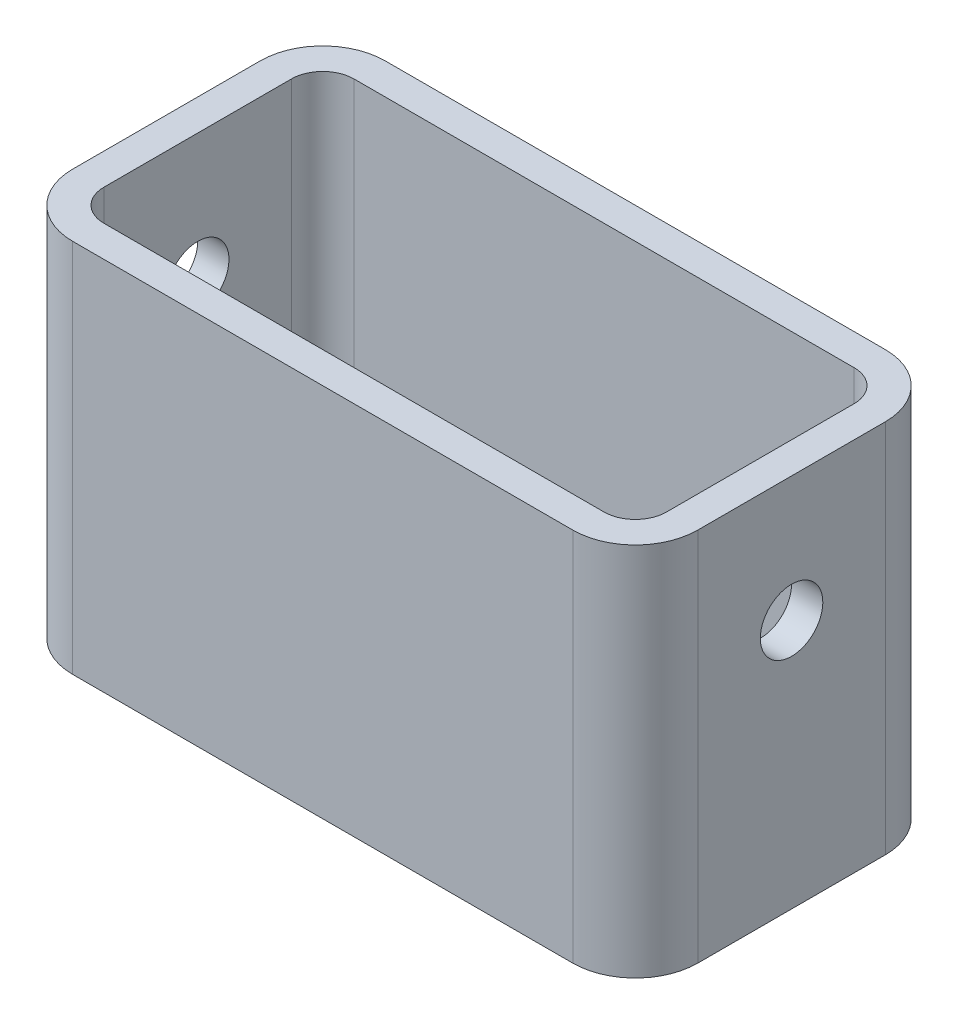
ISO-10303-21;
HEADER;
FILE_DESCRIPTION(('STEP AP214'),'2;1');
FILE_NAME('part.step','',(''),(''),'','','');
FILE_SCHEMA(('AUTOMOTIVE_DESIGN { 1 0 10303 214 1 1 1 1 }'));
ENDSEC;
DATA;
#1=APPLICATION_CONTEXT('core data for automotive mechanical design processes');
#2=APPLICATION_PROTOCOL_DEFINITION('international standard','automotive_design',2000,#1);
#3=PRODUCT_CONTEXT('',#1,'mechanical');
#4=PRODUCT('Part','Part','',(#3));
#5=PRODUCT_RELATED_PRODUCT_CATEGORY('part','',(#4));
#6=PRODUCT_DEFINITION_FORMATION('','',#4);
#7=PRODUCT_DEFINITION_CONTEXT('part definition',#1,'design');
#8=PRODUCT_DEFINITION('design','',#6,#7);
#9=PRODUCT_DEFINITION_SHAPE('','',#8);
#10=(LENGTH_UNIT() NAMED_UNIT(*) SI_UNIT(.MILLI.,.METRE.));
#11=(NAMED_UNIT(*) PLANE_ANGLE_UNIT() SI_UNIT($,.RADIAN.));
#12=(NAMED_UNIT(*) SI_UNIT($,.STERADIAN.) SOLID_ANGLE_UNIT());
#13=UNCERTAINTY_MEASURE_WITH_UNIT(LENGTH_MEASURE(1.E-05),#10,'distance_accuracy_value','');
#14=(GEOMETRIC_REPRESENTATION_CONTEXT(3) GLOBAL_UNCERTAINTY_ASSIGNED_CONTEXT((#13)) GLOBAL_UNIT_ASSIGNED_CONTEXT((#10,
#11,#12)) REPRESENTATION_CONTEXT('',''));
#15=CARTESIAN_POINT('',(0.,0.,0.));
#16=DIRECTION('',(0.,0.,1.));
#17=DIRECTION('',(1.,0.,0.));
#18=AXIS2_PLACEMENT_3D('',#15,#16,#17);
#19=CARTESIAN_POINT('',(0.,0.,50.));
#20=DIRECTION('',(1.,0.,0.));
#21=DIRECTION('',(0.,1.,0.));
#22=AXIS2_PLACEMENT_3D('',#19,#20,#21);
#23=PLANE('',#22);
#24=CARTESIAN_POINT('',(0.,40.,25.));
#25=DIRECTION('',(1.,0.,0.));
#26=DIRECTION('',(0.,1.,0.));
#27=AXIS2_PLACEMENT_3D('',#24,#25,#26);
#28=CIRCLE('',#27,5.);
#29=CARTESIAN_POINT('',(0.,45.,25.));
#30=VERTEX_POINT('',#29);
#31=EDGE_CURVE('E363',#30,#30,#28,.T.);
#32=ORIENTED_EDGE('',*,*,#31,.T.);
#33=EDGE_LOOP('',(#32));
#34=FACE_BOUND('',#33,.T.);
#35=DIRECTION('',(0.,0.,-1.));
#36=VECTOR('',#35,1.);
#37=CARTESIAN_POINT('',(0.,60.,50.));
#38=LINE('',#37,#36);
#39=CARTESIAN_POINT('',(0.,60.,40.));
#40=VERTEX_POINT('',#39);
#41=CARTESIAN_POINT('',(0.,60.,10.));
#42=VERTEX_POINT('',#41);
#43=EDGE_CURVE('E213',#40,#42,#38,.T.);
#44=ORIENTED_EDGE('',*,*,#43,.T.);
#45=DIRECTION('',(0.,-1.,0.));
#46=VECTOR('',#45,1.);
#47=CARTESIAN_POINT('',(0.,0.,10.));
#48=LINE('',#47,#46);
#49=CARTESIAN_POINT('',(0.,0.,10.));
#50=VERTEX_POINT('',#49);
#51=EDGE_CURVE('E231',#42,#50,#48,.T.);
#52=ORIENTED_EDGE('',*,*,#51,.T.);
#53=DIRECTION('',(0.,0.,-1.));
#54=VECTOR('',#53,1.);
#55=CARTESIAN_POINT('',(0.,0.,50.));
#56=LINE('',#55,#54);
#57=CARTESIAN_POINT('',(0.,0.,40.));
#58=VERTEX_POINT('',#57);
#59=EDGE_CURVE('E226',#58,#50,#56,.T.);
#60=ORIENTED_EDGE('',*,*,#59,.F.);
#61=DIRECTION('',(0.,-1.,0.));
#62=VECTOR('',#61,1.);
#63=CARTESIAN_POINT('',(0.,0.,40.));
#64=LINE('',#63,#62);
#65=EDGE_CURVE('E229',#58,#40,#64,.F.);
#66=ORIENTED_EDGE('',*,*,#65,.T.);
#67=EDGE_LOOP('',(#44,#52,#60,#66));
#68=FACE_BOUND('',#67,.T.);
#69=ADVANCED_FACE('F33',(#34,#68),#23,.F.);
#70=CARTESIAN_POINT('',(0.,0.,50.));
#71=DIRECTION('',(0.,1.,0.));
#72=DIRECTION('',(0.,0.,1.));
#73=AXIS2_PLACEMENT_3D('',#70,#71,#72);
#74=PLANE('',#73);
#75=ORIENTED_EDGE('',*,*,#59,.T.);
#76=CARTESIAN_POINT('',(10.,0.,10.));
#77=DIRECTION('',(0.,1.,0.));
#78=DIRECTION('',(0.,0.,1.));
#79=AXIS2_PLACEMENT_3D('',#76,#77,#78);
#80=CIRCLE('',#79,10.);
#81=CARTESIAN_POINT('',(10.,0.,0.));
#82=VERTEX_POINT('',#81);
#83=EDGE_CURVE('E240',#50,#82,#80,.F.);
#84=ORIENTED_EDGE('',*,*,#83,.T.);
#85=DIRECTION('',(1.,0.,0.));
#86=VECTOR('',#85,1.);
#87=CARTESIAN_POINT('',(0.,0.,0.));
#88=LINE('',#87,#86);
#89=CARTESIAN_POINT('',(90.,0.,0.));
#90=VERTEX_POINT('',#89);
#91=EDGE_CURVE('E189',#82,#90,#88,.T.);
#92=ORIENTED_EDGE('',*,*,#91,.T.);
#93=CARTESIAN_POINT('',(90.,0.,10.));
#94=DIRECTION('',(0.,1.,0.));
#95=DIRECTION('',(0.,0.,1.));
#96=AXIS2_PLACEMENT_3D('',#93,#94,#95);
#97=CIRCLE('',#96,10.);
#98=CARTESIAN_POINT('',(100.,0.,10.));
#99=VERTEX_POINT('',#98);
#100=EDGE_CURVE('E238',#90,#99,#97,.F.);
#101=ORIENTED_EDGE('',*,*,#100,.T.);
#102=DIRECTION('',(0.,0.,-1.));
#103=VECTOR('',#102,1.);
#104=CARTESIAN_POINT('',(100.,0.,50.));
#105=LINE('',#104,#103);
#106=CARTESIAN_POINT('',(100.,0.,40.));
#107=VERTEX_POINT('',#106);
#108=EDGE_CURVE('E223',#107,#99,#105,.T.);
#109=ORIENTED_EDGE('',*,*,#108,.F.);
#110=CARTESIAN_POINT('',(90.,0.,40.));
#111=DIRECTION('',(0.,1.,0.));
#112=DIRECTION('',(0.,0.,1.));
#113=AXIS2_PLACEMENT_3D('',#110,#111,#112);
#114=CIRCLE('',#113,10.);
#115=CARTESIAN_POINT('',(90.,0.,50.));
#116=VERTEX_POINT('',#115);
#117=EDGE_CURVE('E234',#107,#116,#114,.F.);
#118=ORIENTED_EDGE('',*,*,#117,.T.);
#119=DIRECTION('',(1.,0.,0.));
#120=VECTOR('',#119,1.);
#121=CARTESIAN_POINT('',(0.,0.,50.));
#122=LINE('',#121,#120);
#123=CARTESIAN_POINT('',(10.,0.,50.));
#124=VERTEX_POINT('',#123);
#125=EDGE_CURVE('E206',#124,#116,#122,.T.);
#126=ORIENTED_EDGE('',*,*,#125,.F.);
#127=CARTESIAN_POINT('',(10.,0.,40.));
#128=DIRECTION('',(0.,1.,0.));
#129=DIRECTION('',(0.,0.,1.));
#130=AXIS2_PLACEMENT_3D('',#127,#128,#129);
#131=CIRCLE('',#130,10.);
#132=EDGE_CURVE('E236',#124,#58,#131,.F.);
#133=ORIENTED_EDGE('',*,*,#132,.T.);
#134=EDGE_LOOP('',(#75,#84,#92,#101,#109,#118,#126,#133));
#135=FACE_BOUND('',#134,.T.);
#136=ADVANCED_FACE('F275',(#135),#74,.F.);
#137=CARTESIAN_POINT('',(100.,0.,50.));
#138=DIRECTION('',(-1.,0.,0.));
#139=DIRECTION('',(0.,-1.,0.));
#140=AXIS2_PLACEMENT_3D('',#137,#138,#139);
#141=PLANE('',#140);
#142=CARTESIAN_POINT('',(100.,40.,25.));
#143=DIRECTION('',(1.,0.,0.));
#144=DIRECTION('',(0.,1.,0.));
#145=AXIS2_PLACEMENT_3D('',#142,#143,#144);
#146=CIRCLE('',#145,5.);
#147=CARTESIAN_POINT('',(100.,45.,25.));
#148=VERTEX_POINT('',#147);
#149=EDGE_CURVE('E361',#148,#148,#146,.T.);
#150=ORIENTED_EDGE('',*,*,#149,.F.);
#151=EDGE_LOOP('',(#150));
#152=FACE_BOUND('',#151,.T.);
#153=ORIENTED_EDGE('',*,*,#108,.T.);
#154=DIRECTION('',(0.,1.,0.));
#155=VECTOR('',#154,1.);
#156=CARTESIAN_POINT('',(100.,60.,10.));
#157=LINE('',#156,#155);
#158=CARTESIAN_POINT('',(100.,60.,10.));
#159=VERTEX_POINT('',#158);
#160=EDGE_CURVE('E255',#99,#159,#157,.T.);
#161=ORIENTED_EDGE('',*,*,#160,.T.);
#162=DIRECTION('',(0.,0.,-1.));
#163=VECTOR('',#162,1.);
#164=CARTESIAN_POINT('',(100.,60.,50.));
#165=LINE('',#164,#163);
#166=CARTESIAN_POINT('',(100.,60.,40.));
#167=VERTEX_POINT('',#166);
#168=EDGE_CURVE('E220',#167,#159,#165,.T.);
#169=ORIENTED_EDGE('',*,*,#168,.F.);
#170=DIRECTION('',(0.,1.,0.));
#171=VECTOR('',#170,1.);
#172=CARTESIAN_POINT('',(100.,0.,40.));
#173=LINE('',#172,#171);
#174=EDGE_CURVE('E253',#167,#107,#173,.F.);
#175=ORIENTED_EDGE('',*,*,#174,.T.);
#176=EDGE_LOOP('',(#153,#161,#169,#175));
#177=FACE_BOUND('',#176,.T.);
#178=ADVANCED_FACE('F280',(#152,#177),#141,.F.);
#179=CARTESIAN_POINT('',(0.,60.,50.));
#180=DIRECTION('',(0.,-1.,0.));
#181=DIRECTION('',(0.,0.,-1.));
#182=AXIS2_PLACEMENT_3D('',#179,#180,#181);
#183=PLANE('',#182);
#184=DIRECTION('',(-1.,0.,0.));
#185=VECTOR('',#184,1.);
#186=CARTESIAN_POINT('',(0.,60.,5.));
#187=LINE('',#186,#185);
#188=CARTESIAN_POINT('',(90.,60.,5.));
#189=VERTEX_POINT('',#188);
#190=CARTESIAN_POINT('',(9.99999999999997,60.,5.));
#191=VERTEX_POINT('',#190);
#192=EDGE_CURVE('E170',#189,#191,#187,.T.);
#193=ORIENTED_EDGE('',*,*,#192,.F.);
#194=CARTESIAN_POINT('',(90.,60.,10.));
#195=DIRECTION('',(0.,-1.,0.));
#196=DIRECTION('',(0.,0.,-1.));
#197=AXIS2_PLACEMENT_3D('',#194,#195,#196);
#198=CIRCLE('',#197,5.);
#199=CARTESIAN_POINT('',(95.,60.,10.));
#200=VERTEX_POINT('',#199);
#201=EDGE_CURVE('E195',#200,#189,#198,.F.);
#202=ORIENTED_EDGE('',*,*,#201,.F.);
#203=DIRECTION('',(0.,0.,-1.));
#204=VECTOR('',#203,1.);
#205=CARTESIAN_POINT('',(95.,60.,50.));
#206=LINE('',#205,#204);
#207=CARTESIAN_POINT('',(95.,60.,40.));
#208=VERTEX_POINT('',#207);
#209=EDGE_CURVE('E49',#208,#200,#206,.T.);
#210=ORIENTED_EDGE('',*,*,#209,.F.);
#211=CARTESIAN_POINT('',(90.,60.,40.));
#212=DIRECTION('',(0.,-1.,0.));
#213=DIRECTION('',(0.,0.,-1.));
#214=AXIS2_PLACEMENT_3D('',#211,#212,#213);
#215=CIRCLE('',#214,5.);
#216=CARTESIAN_POINT('',(90.,60.,45.));
#217=VERTEX_POINT('',#216);
#218=EDGE_CURVE('E176',#217,#208,#215,.F.);
#219=ORIENTED_EDGE('',*,*,#218,.F.);
#220=DIRECTION('',(-1.,0.,0.));
#221=VECTOR('',#220,1.);
#222=CARTESIAN_POINT('',(0.,60.,45.));
#223=LINE('',#222,#221);
#224=CARTESIAN_POINT('',(9.99999999999997,60.,45.));
#225=VERTEX_POINT('',#224);
#226=EDGE_CURVE('E193',#217,#225,#223,.T.);
#227=ORIENTED_EDGE('',*,*,#226,.T.);
#228=CARTESIAN_POINT('',(9.99999999999997,60.,40.));
#229=DIRECTION('',(0.,-1.,0.));
#230=DIRECTION('',(0.,0.,-1.));
#231=AXIS2_PLACEMENT_3D('',#228,#229,#230);
#232=CIRCLE('',#231,5.);
#233=CARTESIAN_POINT('',(4.99999999999997,60.,40.));
#234=VERTEX_POINT('',#233);
#235=EDGE_CURVE('E178',#234,#225,#232,.F.);
#236=ORIENTED_EDGE('',*,*,#235,.F.);
#237=DIRECTION('',(0.,0.,-1.));
#238=VECTOR('',#237,1.);
#239=CARTESIAN_POINT('',(4.99999999999997,60.,50.));
#240=LINE('',#239,#238);
#241=CARTESIAN_POINT('',(4.99999999999997,60.,10.));
#242=VERTEX_POINT('',#241);
#243=EDGE_CURVE('E190',#234,#242,#240,.T.);
#244=ORIENTED_EDGE('',*,*,#243,.T.);
#245=CARTESIAN_POINT('',(9.99999999999997,60.,10.));
#246=DIRECTION('',(0.,-1.,0.));
#247=DIRECTION('',(0.,0.,-1.));
#248=AXIS2_PLACEMENT_3D('',#245,#246,#247);
#249=CIRCLE('',#248,5.);
#250=EDGE_CURVE('E202',#191,#242,#249,.F.);
#251=ORIENTED_EDGE('',*,*,#250,.F.);
#252=EDGE_LOOP('',(#193,#202,#210,#219,#227,#236,#244,#251));
#253=FACE_BOUND('',#252,.T.);
#254=DIRECTION('',(-1.,0.,0.));
#255=VECTOR('',#254,1.);
#256=CARTESIAN_POINT('',(0.,60.,0.));
#257=LINE('',#256,#255);
#258=CARTESIAN_POINT('',(90.,60.,0.));
#259=VERTEX_POINT('',#258);
#260=CARTESIAN_POINT('',(9.99999999999997,60.,0.));
#261=VERTEX_POINT('',#260);
#262=EDGE_CURVE('E210',#259,#261,#257,.T.);
#263=ORIENTED_EDGE('',*,*,#262,.T.);
#264=CARTESIAN_POINT('',(9.99999999999997,60.,10.));
#265=DIRECTION('',(0.,-1.,0.));
#266=DIRECTION('',(0.,0.,-1.));
#267=AXIS2_PLACEMENT_3D('',#264,#265,#266);
#268=CIRCLE('',#267,10.);
#269=EDGE_CURVE('E251',#261,#42,#268,.F.);
#270=ORIENTED_EDGE('',*,*,#269,.T.);
#271=ORIENTED_EDGE('',*,*,#43,.F.);
#272=CARTESIAN_POINT('',(9.99999999999997,60.,40.));
#273=DIRECTION('',(0.,-1.,0.));
#274=DIRECTION('',(0.,0.,-1.));
#275=AXIS2_PLACEMENT_3D('',#272,#273,#274);
#276=CIRCLE('',#275,10.);
#277=CARTESIAN_POINT('',(9.99999999999997,60.,50.));
#278=VERTEX_POINT('',#277);
#279=EDGE_CURVE('E248',#40,#278,#276,.F.);
#280=ORIENTED_EDGE('',*,*,#279,.T.);
#281=DIRECTION('',(-1.,0.,0.));
#282=VECTOR('',#281,1.);
#283=CARTESIAN_POINT('',(0.,60.,50.));
#284=LINE('',#283,#282);
#285=CARTESIAN_POINT('',(90.,60.,50.));
#286=VERTEX_POINT('',#285);
#287=EDGE_CURVE('E209',#286,#278,#284,.T.);
#288=ORIENTED_EDGE('',*,*,#287,.F.);
#289=CARTESIAN_POINT('',(90.,60.,40.));
#290=DIRECTION('',(0.,-1.,0.));
#291=DIRECTION('',(0.,0.,-1.));
#292=AXIS2_PLACEMENT_3D('',#289,#290,#291);
#293=CIRCLE('',#292,10.);
#294=EDGE_CURVE('E246',#286,#167,#293,.F.);
#295=ORIENTED_EDGE('',*,*,#294,.T.);
#296=ORIENTED_EDGE('',*,*,#168,.T.);
#297=CARTESIAN_POINT('',(90.,60.,10.));
#298=DIRECTION('',(0.,-1.,0.));
#299=DIRECTION('',(0.,0.,-1.));
#300=AXIS2_PLACEMENT_3D('',#297,#298,#299);
#301=CIRCLE('',#300,10.);
#302=EDGE_CURVE('E57',#159,#259,#301,.F.);
#303=ORIENTED_EDGE('',*,*,#302,.T.);
#304=EDGE_LOOP('',(#263,#270,#271,#280,#288,#295,#296,#303));
#305=FACE_BOUND('',#304,.T.);
#306=ADVANCED_FACE('F267',(#253,#305),#183,.F.);
#307=CARTESIAN_POINT('',(0.,0.,50.));
#308=DIRECTION('',(0.,0.,-1.));
#309=DIRECTION('',(-1.,0.,0.));
#310=AXIS2_PLACEMENT_3D('',#307,#308,#309);
#311=PLANE('',#310);
#312=ORIENTED_EDGE('',*,*,#287,.T.);
#313=DIRECTION('',(0.,-1.,0.));
#314=VECTOR('',#313,1.);
#315=CARTESIAN_POINT('',(10.,0.,50.));
#316=LINE('',#315,#314);
#317=EDGE_CURVE('E11',#278,#124,#316,.T.);
#318=ORIENTED_EDGE('',*,*,#317,.T.);
#319=ORIENTED_EDGE('',*,*,#125,.T.);
#320=DIRECTION('',(0.,1.,0.));
#321=VECTOR('',#320,1.);
#322=CARTESIAN_POINT('',(90.,0.,50.));
#323=LINE('',#322,#321);
#324=EDGE_CURVE('E42',#116,#286,#323,.T.);
#325=ORIENTED_EDGE('',*,*,#324,.T.);
#326=EDGE_LOOP('',(#312,#318,#319,#325));
#327=FACE_BOUND('',#326,.T.);
#328=ADVANCED_FACE('F261',(#327),#311,.F.);
#329=CARTESIAN_POINT('',(0.,0.,0.));
#330=DIRECTION('',(0.,0.,-1.));
#331=DIRECTION('',(-1.,0.,0.));
#332=AXIS2_PLACEMENT_3D('',#329,#330,#331);
#333=PLANE('',#332);
#334=ORIENTED_EDGE('',*,*,#91,.F.);
#335=DIRECTION('',(0.,-1.,0.));
#336=VECTOR('',#335,1.);
#337=CARTESIAN_POINT('',(9.99999999999997,60.,0.));
#338=LINE('',#337,#336);
#339=EDGE_CURVE('E244',#82,#261,#338,.F.);
#340=ORIENTED_EDGE('',*,*,#339,.T.);
#341=ORIENTED_EDGE('',*,*,#262,.F.);
#342=DIRECTION('',(0.,1.,0.));
#343=VECTOR('',#342,1.);
#344=CARTESIAN_POINT('',(90.,0.,0.));
#345=LINE('',#344,#343);
#346=EDGE_CURVE('E242',#259,#90,#345,.F.);
#347=ORIENTED_EDGE('',*,*,#346,.T.);
#348=EDGE_LOOP('',(#334,#340,#341,#347));
#349=FACE_BOUND('',#348,.T.);
#350=ADVANCED_FACE('F285',(#349),#333,.T.);
#351=CARTESIAN_POINT('',(10.,0.,10.));
#352=DIRECTION('',(0.,1.,0.));
#353=DIRECTION('',(-1.,0.,0.));
#354=AXIS2_PLACEMENT_3D('',#351,#352,#353);
#355=CYLINDRICAL_SURFACE('',#354,10.);
#356=ORIENTED_EDGE('',*,*,#269,.F.);
#357=ORIENTED_EDGE('',*,*,#339,.F.);
#358=ORIENTED_EDGE('',*,*,#83,.F.);
#359=ORIENTED_EDGE('',*,*,#51,.F.);
#360=EDGE_LOOP('',(#356,#357,#358,#359));
#361=FACE_BOUND('',#360,.T.);
#362=ADVANCED_FACE('F290',(#361),#355,.T.);
#363=CARTESIAN_POINT('',(90.,0.,10.));
#364=DIRECTION('',(0.,-1.,0.));
#365=DIRECTION('',(1.,0.,0.));
#366=AXIS2_PLACEMENT_3D('',#363,#364,#365);
#367=CYLINDRICAL_SURFACE('',#366,10.);
#368=ORIENTED_EDGE('',*,*,#100,.F.);
#369=ORIENTED_EDGE('',*,*,#346,.F.);
#370=ORIENTED_EDGE('',*,*,#302,.F.);
#371=ORIENTED_EDGE('',*,*,#160,.F.);
#372=EDGE_LOOP('',(#368,#369,#370,#371));
#373=FACE_BOUND('',#372,.T.);
#374=ADVANCED_FACE('F288',(#373),#367,.T.);
#375=CARTESIAN_POINT('',(10.,0.,40.));
#376=DIRECTION('',(0.,-1.,0.));
#377=DIRECTION('',(1.,0.,0.));
#378=AXIS2_PLACEMENT_3D('',#375,#376,#377);
#379=CYLINDRICAL_SURFACE('',#378,10.);
#380=ORIENTED_EDGE('',*,*,#279,.F.);
#381=ORIENTED_EDGE('',*,*,#65,.F.);
#382=ORIENTED_EDGE('',*,*,#132,.F.);
#383=ORIENTED_EDGE('',*,*,#317,.F.);
#384=EDGE_LOOP('',(#380,#381,#382,#383));
#385=FACE_BOUND('',#384,.T.);
#386=ADVANCED_FACE('F273',(#385),#379,.T.);
#387=CARTESIAN_POINT('',(90.,0.,40.));
#388=DIRECTION('',(0.,1.,0.));
#389=DIRECTION('',(-1.,0.,0.));
#390=AXIS2_PLACEMENT_3D('',#387,#388,#389);
#391=CYLINDRICAL_SURFACE('',#390,10.);
#392=ORIENTED_EDGE('',*,*,#117,.F.);
#393=ORIENTED_EDGE('',*,*,#174,.F.);
#394=ORIENTED_EDGE('',*,*,#294,.F.);
#395=ORIENTED_EDGE('',*,*,#324,.F.);
#396=EDGE_LOOP('',(#392,#393,#394,#395));
#397=FACE_BOUND('',#396,.T.);
#398=ADVANCED_FACE('F35',(#397),#391,.T.);
#399=CARTESIAN_POINT('',(5.,0.,50.));
#400=DIRECTION('',(1.,0.,0.));
#401=DIRECTION('',(0.,1.,0.));
#402=AXIS2_PLACEMENT_3D('',#399,#400,#401);
#403=PLANE('',#402);
#404=CARTESIAN_POINT('',(4.99999999999998,40.,25.));
#405=DIRECTION('',(1.,0.,0.));
#406=DIRECTION('',(0.,1.,0.));
#407=AXIS2_PLACEMENT_3D('',#404,#405,#406);
#408=CIRCLE('',#407,5.);
#409=CARTESIAN_POINT('',(4.99999999999998,45.,25.));
#410=VERTEX_POINT('',#409);
#411=EDGE_CURVE('E171',#410,#410,#408,.T.);
#412=ORIENTED_EDGE('',*,*,#411,.F.);
#413=EDGE_LOOP('',(#412));
#414=FACE_BOUND('',#413,.T.);
#415=ORIENTED_EDGE('',*,*,#243,.F.);
#416=DIRECTION('',(0.,1.,0.));
#417=VECTOR('',#416,1.);
#418=CARTESIAN_POINT('',(5.,0.,40.));
#419=LINE('',#418,#417);
#420=CARTESIAN_POINT('',(5.,5.,40.));
#421=VERTEX_POINT('',#420);
#422=EDGE_CURVE('E371',#421,#234,#419,.T.);
#423=ORIENTED_EDGE('',*,*,#422,.F.);
#424=DIRECTION('',(0.,0.,-1.));
#425=VECTOR('',#424,1.);
#426=CARTESIAN_POINT('',(5.,5.,50.));
#427=LINE('',#426,#425);
#428=CARTESIAN_POINT('',(5.,5.,10.));
#429=VERTEX_POINT('',#428);
#430=EDGE_CURVE('E372',#421,#429,#427,.T.);
#431=ORIENTED_EDGE('',*,*,#430,.T.);
#432=DIRECTION('',(0.,1.,0.));
#433=VECTOR('',#432,1.);
#434=CARTESIAN_POINT('',(5.,0.,10.));
#435=LINE('',#434,#433);
#436=EDGE_CURVE('E156',#242,#429,#435,.F.);
#437=ORIENTED_EDGE('',*,*,#436,.F.);
#438=EDGE_LOOP('',(#415,#423,#431,#437));
#439=FACE_BOUND('',#438,.T.);
#440=ADVANCED_FACE('F310',(#414,#439),#403,.T.);
#441=CARTESIAN_POINT('',(0.,5.,50.));
#442=DIRECTION('',(0.,1.,0.));
#443=DIRECTION('',(0.,0.,1.));
#444=AXIS2_PLACEMENT_3D('',#441,#442,#443);
#445=PLANE('',#444);
#446=ORIENTED_EDGE('',*,*,#430,.F.);
#447=CARTESIAN_POINT('',(10.,5.,40.));
#448=DIRECTION('',(0.,1.,0.));
#449=DIRECTION('',(0.,0.,1.));
#450=AXIS2_PLACEMENT_3D('',#447,#448,#449);
#451=CIRCLE('',#450,5.);
#452=CARTESIAN_POINT('',(9.99999999999997,5.,45.));
#453=VERTEX_POINT('',#452);
#454=EDGE_CURVE('E376',#453,#421,#451,.F.);
#455=ORIENTED_EDGE('',*,*,#454,.F.);
#456=DIRECTION('',(1.,0.,0.));
#457=VECTOR('',#456,1.);
#458=CARTESIAN_POINT('',(0.,5.,45.));
#459=LINE('',#458,#457);
#460=CARTESIAN_POINT('',(90.,5.,45.));
#461=VERTEX_POINT('',#460);
#462=EDGE_CURVE('E197',#453,#461,#459,.T.);
#463=ORIENTED_EDGE('',*,*,#462,.T.);
#464=CARTESIAN_POINT('',(90.,5.,40.));
#465=DIRECTION('',(0.,1.,0.));
#466=DIRECTION('',(0.,0.,1.));
#467=AXIS2_PLACEMENT_3D('',#464,#465,#466);
#468=CIRCLE('',#467,5.);
#469=CARTESIAN_POINT('',(95.,5.,40.));
#470=VERTEX_POINT('',#469);
#471=EDGE_CURVE('E370',#470,#461,#468,.F.);
#472=ORIENTED_EDGE('',*,*,#471,.F.);
#473=DIRECTION('',(0.,0.,-1.));
#474=VECTOR('',#473,1.);
#475=CARTESIAN_POINT('',(95.,5.,50.));
#476=LINE('',#475,#474);
#477=CARTESIAN_POINT('',(95.,5.,10.));
#478=VERTEX_POINT('',#477);
#479=EDGE_CURVE('E200',#470,#478,#476,.T.);
#480=ORIENTED_EDGE('',*,*,#479,.T.);
#481=CARTESIAN_POINT('',(90.,5.,10.));
#482=DIRECTION('',(0.,1.,0.));
#483=DIRECTION('',(0.,0.,1.));
#484=AXIS2_PLACEMENT_3D('',#481,#482,#483);
#485=CIRCLE('',#484,5.);
#486=CARTESIAN_POINT('',(90.,5.,5.));
#487=VERTEX_POINT('',#486);
#488=EDGE_CURVE('E161',#487,#478,#485,.F.);
#489=ORIENTED_EDGE('',*,*,#488,.F.);
#490=DIRECTION('',(1.,0.,0.));
#491=VECTOR('',#490,1.);
#492=CARTESIAN_POINT('',(0.,5.,5.));
#493=LINE('',#492,#491);
#494=CARTESIAN_POINT('',(10.,5.,5.));
#495=VERTEX_POINT('',#494);
#496=EDGE_CURVE('E165',#495,#487,#493,.T.);
#497=ORIENTED_EDGE('',*,*,#496,.F.);
#498=CARTESIAN_POINT('',(10.,5.,10.));
#499=DIRECTION('',(0.,1.,0.));
#500=DIRECTION('',(0.,0.,1.));
#501=AXIS2_PLACEMENT_3D('',#498,#499,#500);
#502=CIRCLE('',#501,5.);
#503=EDGE_CURVE('E149',#429,#495,#502,.F.);
#504=ORIENTED_EDGE('',*,*,#503,.F.);
#505=EDGE_LOOP('',(#446,#455,#463,#472,#480,#489,#497,#504));
#506=FACE_BOUND('',#505,.T.);
#507=ADVANCED_FACE('F166',(#506),#445,.T.);
#508=CARTESIAN_POINT('',(95.,0.,50.));
#509=DIRECTION('',(-1.,0.,0.));
#510=DIRECTION('',(0.,-1.,0.));
#511=AXIS2_PLACEMENT_3D('',#508,#509,#510);
#512=PLANE('',#511);
#513=CARTESIAN_POINT('',(95.,40.,25.));
#514=DIRECTION('',(-1.,0.,0.));
#515=DIRECTION('',(0.,-1.,0.));
#516=AXIS2_PLACEMENT_3D('',#513,#514,#515);
#517=CIRCLE('',#516,5.);
#518=CARTESIAN_POINT('',(95.,35.,25.));
#519=VERTEX_POINT('',#518);
#520=EDGE_CURVE('E37',#519,#519,#517,.T.);
#521=ORIENTED_EDGE('',*,*,#520,.F.);
#522=EDGE_LOOP('',(#521));
#523=FACE_BOUND('',#522,.T.);
#524=ORIENTED_EDGE('',*,*,#479,.F.);
#525=DIRECTION('',(0.,-1.,0.));
#526=VECTOR('',#525,1.);
#527=CARTESIAN_POINT('',(95.,0.,40.));
#528=LINE('',#527,#526);
#529=EDGE_CURVE('E205',#208,#470,#528,.T.);
#530=ORIENTED_EDGE('',*,*,#529,.F.);
#531=ORIENTED_EDGE('',*,*,#209,.T.);
#532=DIRECTION('',(0.,-1.,0.));
#533=VECTOR('',#532,1.);
#534=CARTESIAN_POINT('',(95.,0.,10.));
#535=LINE('',#534,#533);
#536=EDGE_CURVE('E186',#478,#200,#535,.F.);
#537=ORIENTED_EDGE('',*,*,#536,.F.);
#538=EDGE_LOOP('',(#524,#530,#531,#537));
#539=FACE_BOUND('',#538,.T.);
#540=ADVANCED_FACE('F319',(#523,#539),#512,.T.);
#541=CARTESIAN_POINT('',(0.,0.,45.));
#542=DIRECTION('',(0.,0.,-1.));
#543=DIRECTION('',(-1.,0.,0.));
#544=AXIS2_PLACEMENT_3D('',#541,#542,#543);
#545=PLANE('',#544);
#546=ORIENTED_EDGE('',*,*,#226,.F.);
#547=DIRECTION('',(0.,1.,0.));
#548=VECTOR('',#547,1.);
#549=CARTESIAN_POINT('',(90.,0.,45.));
#550=LINE('',#549,#548);
#551=EDGE_CURVE('E183',#461,#217,#550,.T.);
#552=ORIENTED_EDGE('',*,*,#551,.F.);
#553=ORIENTED_EDGE('',*,*,#462,.F.);
#554=DIRECTION('',(0.,1.,0.));
#555=VECTOR('',#554,1.);
#556=CARTESIAN_POINT('',(9.99999999999997,0.,45.));
#557=LINE('',#556,#555);
#558=EDGE_CURVE('E185',#225,#453,#557,.F.);
#559=ORIENTED_EDGE('',*,*,#558,.F.);
#560=EDGE_LOOP('',(#546,#552,#553,#559));
#561=FACE_BOUND('',#560,.T.);
#562=ADVANCED_FACE('F328',(#561),#545,.T.);
#563=CARTESIAN_POINT('',(0.,0.,5.));
#564=DIRECTION('',(0.,0.,-1.));
#565=DIRECTION('',(-1.,0.,0.));
#566=AXIS2_PLACEMENT_3D('',#563,#564,#565);
#567=PLANE('',#566);
#568=ORIENTED_EDGE('',*,*,#496,.T.);
#569=DIRECTION('',(0.,1.,0.));
#570=VECTOR('',#569,1.);
#571=CARTESIAN_POINT('',(90.,0.,5.));
#572=LINE('',#571,#570);
#573=EDGE_CURVE('E160',#189,#487,#572,.F.);
#574=ORIENTED_EDGE('',*,*,#573,.F.);
#575=ORIENTED_EDGE('',*,*,#192,.T.);
#576=DIRECTION('',(0.,1.,0.));
#577=VECTOR('',#576,1.);
#578=CARTESIAN_POINT('',(10.,0.,5.));
#579=LINE('',#578,#577);
#580=EDGE_CURVE('E153',#495,#191,#579,.T.);
#581=ORIENTED_EDGE('',*,*,#580,.F.);
#582=EDGE_LOOP('',(#568,#574,#575,#581));
#583=FACE_BOUND('',#582,.T.);
#584=ADVANCED_FACE('F173',(#583),#567,.F.);
#585=CARTESIAN_POINT('',(10.,0.,10.));
#586=DIRECTION('',(0.,1.,0.));
#587=DIRECTION('',(-1.,0.,0.));
#588=AXIS2_PLACEMENT_3D('',#585,#586,#587);
#589=CYLINDRICAL_SURFACE('',#588,5.);
#590=ORIENTED_EDGE('',*,*,#250,.T.);
#591=ORIENTED_EDGE('',*,*,#436,.T.);
#592=ORIENTED_EDGE('',*,*,#503,.T.);
#593=ORIENTED_EDGE('',*,*,#580,.T.);
#594=EDGE_LOOP('',(#590,#591,#592,#593));
#595=FACE_BOUND('',#594,.T.);
#596=ADVANCED_FACE('F151',(#595),#589,.F.);
#597=CARTESIAN_POINT('',(90.,0.,10.));
#598=DIRECTION('',(0.,-1.,0.));
#599=DIRECTION('',(1.,0.,0.));
#600=AXIS2_PLACEMENT_3D('',#597,#598,#599);
#601=CYLINDRICAL_SURFACE('',#600,5.);
#602=ORIENTED_EDGE('',*,*,#488,.T.);
#603=ORIENTED_EDGE('',*,*,#536,.T.);
#604=ORIENTED_EDGE('',*,*,#201,.T.);
#605=ORIENTED_EDGE('',*,*,#573,.T.);
#606=EDGE_LOOP('',(#602,#603,#604,#605));
#607=FACE_BOUND('',#606,.T.);
#608=ADVANCED_FACE('F337',(#607),#601,.F.);
#609=CARTESIAN_POINT('',(10.,0.,40.));
#610=DIRECTION('',(0.,-1.,0.));
#611=DIRECTION('',(1.,0.,0.));
#612=AXIS2_PLACEMENT_3D('',#609,#610,#611);
#613=CYLINDRICAL_SURFACE('',#612,5.);
#614=ORIENTED_EDGE('',*,*,#235,.T.);
#615=ORIENTED_EDGE('',*,*,#558,.T.);
#616=ORIENTED_EDGE('',*,*,#454,.T.);
#617=ORIENTED_EDGE('',*,*,#422,.T.);
#618=EDGE_LOOP('',(#614,#615,#616,#617));
#619=FACE_BOUND('',#618,.T.);
#620=ADVANCED_FACE('F340',(#619),#613,.F.);
#621=CARTESIAN_POINT('',(90.,0.,40.));
#622=DIRECTION('',(0.,1.,0.));
#623=DIRECTION('',(-1.,0.,0.));
#624=AXIS2_PLACEMENT_3D('',#621,#622,#623);
#625=CYLINDRICAL_SURFACE('',#624,5.);
#626=ORIENTED_EDGE('',*,*,#471,.T.);
#627=ORIENTED_EDGE('',*,*,#551,.T.);
#628=ORIENTED_EDGE('',*,*,#218,.T.);
#629=ORIENTED_EDGE('',*,*,#529,.T.);
#630=EDGE_LOOP('',(#626,#627,#628,#629));
#631=FACE_BOUND('',#630,.T.);
#632=ADVANCED_FACE('F344',(#631),#625,.F.);
#633=CARTESIAN_POINT('',(0.,40.,25.));
#634=DIRECTION('',(1.,0.,0.));
#635=DIRECTION('',(0.,1.,0.));
#636=AXIS2_PLACEMENT_3D('',#633,#634,#635);
#637=CYLINDRICAL_SURFACE('',#636,5.);
#638=ORIENTED_EDGE('',*,*,#520,.T.);
#639=EDGE_LOOP('',(#638));
#640=FACE_BOUND('',#639,.T.);
#641=ORIENTED_EDGE('',*,*,#149,.T.);
#642=EDGE_LOOP('',(#641));
#643=FACE_BOUND('',#642,.T.);
#644=ADVANCED_FACE('F324',(#640,#643),#637,.F.);
#645=ORIENTED_EDGE('',*,*,#411,.T.);
#646=EDGE_LOOP('',(#645));
#647=FACE_BOUND('',#646,.T.);
#648=ORIENTED_EDGE('',*,*,#31,.F.);
#649=EDGE_LOOP('',(#648));
#650=FACE_BOUND('',#649,.T.);
#651=ADVANCED_FACE('F398',(#647,#650),#637,.F.);
#652=CLOSED_SHELL('',(#69,#136,#178,#306,#328,#350,#362,#374,#386,#398,#440,#507,#540,#562,#584,
#596,#608,#620,#632,#644,#651));
#653=MANIFOLD_SOLID_BREP('B2',#652);
#654=ADVANCED_BREP_SHAPE_REPRESENTATION('',(#18,#653),#14);
#655=SHAPE_DEFINITION_REPRESENTATION(#9,#654);
ENDSEC;
END-ISO-10303-21;
